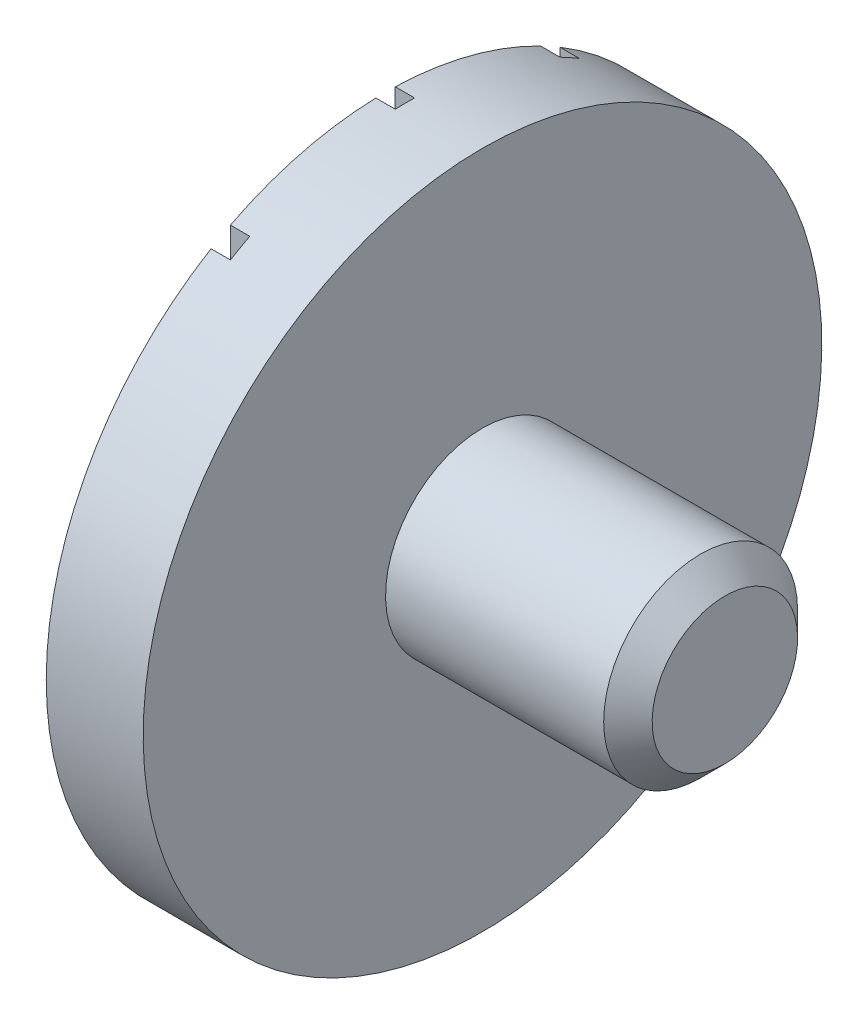
ISO-10303-21;
HEADER;
FILE_DESCRIPTION(('STEP AP214'),'2;1');
FILE_NAME('part.step','',(''),(''),'','','');
FILE_SCHEMA(('AUTOMOTIVE_DESIGN { 1 0 10303 214 1 1 1 1 }'));
ENDSEC;
DATA;
#1=APPLICATION_CONTEXT('core data for automotive mechanical design processes');
#2=APPLICATION_PROTOCOL_DEFINITION('international standard','automotive_design',2000,#1);
#3=PRODUCT_CONTEXT('',#1,'mechanical');
#4=PRODUCT('Part','Part','',(#3));
#5=PRODUCT_RELATED_PRODUCT_CATEGORY('part','',(#4));
#6=PRODUCT_DEFINITION_FORMATION('','',#4);
#7=PRODUCT_DEFINITION_CONTEXT('part definition',#1,'design');
#8=PRODUCT_DEFINITION('design','',#6,#7);
#9=PRODUCT_DEFINITION_SHAPE('','',#8);
#10=(LENGTH_UNIT() NAMED_UNIT(*) SI_UNIT(.MILLI.,.METRE.));
#11=(NAMED_UNIT(*) PLANE_ANGLE_UNIT() SI_UNIT($,.RADIAN.));
#12=(NAMED_UNIT(*) SI_UNIT($,.STERADIAN.) SOLID_ANGLE_UNIT());
#13=UNCERTAINTY_MEASURE_WITH_UNIT(LENGTH_MEASURE(1.E-05),#10,'distance_accuracy_value','');
#14=(GEOMETRIC_REPRESENTATION_CONTEXT(3) GLOBAL_UNCERTAINTY_ASSIGNED_CONTEXT((#13)) GLOBAL_UNIT_ASSIGNED_CONTEXT((#10,
#11,#12)) REPRESENTATION_CONTEXT('',''));
#15=CARTESIAN_POINT('',(0.,0.,0.));
#16=DIRECTION('',(0.,0.,1.));
#17=DIRECTION('',(1.,0.,0.));
#18=AXIS2_PLACEMENT_3D('',#15,#16,#17);
#19=CARTESIAN_POINT('',(0.,0.,0.));
#20=DIRECTION('',(1.,0.,0.));
#21=DIRECTION('',(0.,1.,0.));
#22=AXIS2_PLACEMENT_3D('',#19,#20,#21);
#23=PLANE('',#22);
#24=CARTESIAN_POINT('',(0.,0.,0.));
#25=DIRECTION('',(1.,0.,0.));
#26=DIRECTION('',(0.,1.,0.));
#27=AXIS2_PLACEMENT_3D('',#24,#25,#26);
#28=CIRCLE('',#27,1.75);
#29=CARTESIAN_POINT('',(0.,-1.50083310198037,-0.9));
#30=VERTEX_POINT('',#29);
#31=CARTESIAN_POINT('',(0.,1.50083310198037,-0.9));
#32=VERTEX_POINT('',#31);
#33=EDGE_CURVE('E257',#30,#32,#28,.T.);
#34=ORIENTED_EDGE('',*,*,#33,.F.);
#35=DIRECTION('',(0.,-1.,0.));
#36=VECTOR('',#35,1.);
#37=CARTESIAN_POINT('',(0.,-1.50083310198037,-0.9));
#38=LINE('',#37,#36);
#39=EDGE_CURVE('E141',#32,#30,#38,.T.);
#40=ORIENTED_EDGE('',*,*,#39,.F.);
#41=EDGE_LOOP('',(#34,#40));
#42=FACE_BOUND('',#41,.T.);
#43=ADVANCED_FACE('F36',(#42),#23,.F.);
#44=CARTESIAN_POINT('',(0.,1.50083310198037,0.9));
#45=VERTEX_POINT('',#44);
#46=CARTESIAN_POINT('',(0.,-1.50083310198037,0.9));
#47=VERTEX_POINT('',#46);
#48=EDGE_CURVE('E213',#45,#47,#28,.T.);
#49=ORIENTED_EDGE('',*,*,#48,.F.);
#50=DIRECTION('',(0.,1.,0.));
#51=VECTOR('',#50,1.);
#52=CARTESIAN_POINT('',(0.,-1.50083310198037,0.9));
#53=LINE('',#52,#51);
#54=EDGE_CURVE('E159',#47,#45,#53,.T.);
#55=ORIENTED_EDGE('',*,*,#54,.F.);
#56=EDGE_LOOP('',(#49,#55));
#57=FACE_BOUND('',#56,.T.);
#58=ADVANCED_FACE('F233',(#57),#23,.F.);
#59=CARTESIAN_POINT('',(0.,1.55643824162734,-0.8));
#60=VERTEX_POINT('',#59);
#61=CARTESIAN_POINT('',(0.,1.74928556845359,-0.0499999999999998));
#62=VERTEX_POINT('',#61);
#63=EDGE_CURVE('E210',#60,#62,#28,.T.);
#64=ORIENTED_EDGE('',*,*,#63,.F.);
#65=DIRECTION('',(0.,1.,0.));
#66=VECTOR('',#65,1.);
#67=CARTESIAN_POINT('',(0.,-1.55643824162734,-0.8));
#68=LINE('',#67,#66);
#69=CARTESIAN_POINT('',(0.,-1.55643824162734,-0.8));
#70=VERTEX_POINT('',#69);
#71=EDGE_CURVE('E266',#70,#60,#68,.T.);
#72=ORIENTED_EDGE('',*,*,#71,.F.);
#73=CARTESIAN_POINT('',(0.,-1.74928556845359,-0.05));
#74=VERTEX_POINT('',#73);
#75=EDGE_CURVE('E149',#74,#70,#28,.T.);
#76=ORIENTED_EDGE('',*,*,#75,.F.);
#77=DIRECTION('',(0.,-1.,0.));
#78=VECTOR('',#77,1.);
#79=CARTESIAN_POINT('',(0.,-1.74928556845359,-0.05));
#80=LINE('',#79,#78);
#81=EDGE_CURVE('E184',#62,#74,#80,.T.);
#82=ORIENTED_EDGE('',*,*,#81,.F.);
#83=EDGE_LOOP('',(#64,#72,#76,#82));
#84=FACE_BOUND('',#83,.T.);
#85=ADVANCED_FACE('F239',(#84),#23,.F.);
#86=CARTESIAN_POINT('',(0.,-1.55643824162734,0.8));
#87=VERTEX_POINT('',#86);
#88=CARTESIAN_POINT('',(0.,-1.74928556845359,0.05));
#89=VERTEX_POINT('',#88);
#90=EDGE_CURVE('E254',#87,#89,#28,.T.);
#91=ORIENTED_EDGE('',*,*,#90,.F.);
#92=DIRECTION('',(0.,-1.,0.));
#93=VECTOR('',#92,1.);
#94=CARTESIAN_POINT('',(0.,-1.55643824162734,0.8));
#95=LINE('',#94,#93);
#96=CARTESIAN_POINT('',(0.,1.55643824162734,0.8));
#97=VERTEX_POINT('',#96);
#98=EDGE_CURVE('E166',#97,#87,#95,.T.);
#99=ORIENTED_EDGE('',*,*,#98,.F.);
#100=CARTESIAN_POINT('',(0.,1.74928556845359,0.05));
#101=VERTEX_POINT('',#100);
#102=EDGE_CURVE('E211',#101,#97,#28,.T.);
#103=ORIENTED_EDGE('',*,*,#102,.F.);
#104=DIRECTION('',(0.,1.,0.));
#105=VECTOR('',#104,1.);
#106=CARTESIAN_POINT('',(0.,-1.74928556845359,0.05));
#107=LINE('',#106,#105);
#108=EDGE_CURVE('E173',#89,#101,#107,.T.);
#109=ORIENTED_EDGE('',*,*,#108,.F.);
#110=EDGE_LOOP('',(#91,#99,#103,#109));
#111=FACE_BOUND('',#110,.T.);
#112=ADVANCED_FACE('F235',(#111),#23,.F.);
#113=CARTESIAN_POINT('',(1.75,0.,0.));
#114=DIRECTION('',(1.,0.,0.));
#115=DIRECTION('',(0.,1.,0.));
#116=AXIS2_PLACEMENT_3D('',#113,#114,#115);
#117=CYLINDRICAL_SURFACE('',#116,1.75);
#118=ORIENTED_EDGE('',*,*,#33,.T.);
#119=DIRECTION('',(-1.,0.,0.));
#120=VECTOR('',#119,1.);
#121=CARTESIAN_POINT('',(0.100000000000004,1.50083310198037,-0.9));
#122=LINE('',#121,#120);
#123=CARTESIAN_POINT('',(0.100000000000004,1.50083310198037,-0.9));
#124=VERTEX_POINT('',#123);
#125=EDGE_CURVE('E151',#124,#32,#122,.T.);
#126=ORIENTED_EDGE('',*,*,#125,.F.);
#127=CARTESIAN_POINT('',(0.1,0.,0.));
#128=DIRECTION('',(-1.,0.,0.));
#129=DIRECTION('',(0.,-1.,0.));
#130=AXIS2_PLACEMENT_3D('',#127,#128,#129);
#131=CIRCLE('',#130,1.75);
#132=CARTESIAN_POINT('',(0.100000000000004,1.55643824162734,-0.8));
#133=VERTEX_POINT('',#132);
#134=EDGE_CURVE('E134',#133,#124,#131,.T.);
#135=ORIENTED_EDGE('',*,*,#134,.F.);
#136=DIRECTION('',(-1.,0.,0.));
#137=VECTOR('',#136,1.);
#138=CARTESIAN_POINT('',(0.100000000000004,1.55643824162734,-0.8));
#139=LINE('',#138,#137);
#140=EDGE_CURVE('E132',#133,#60,#139,.T.);
#141=ORIENTED_EDGE('',*,*,#140,.T.);
#142=ORIENTED_EDGE('',*,*,#63,.T.);
#143=DIRECTION('',(-1.,0.,0.));
#144=VECTOR('',#143,1.);
#145=CARTESIAN_POINT('',(0.100000000000005,1.74928556845359,-0.0499999999999998));
#146=LINE('',#145,#144);
#147=CARTESIAN_POINT('',(0.100000000000005,1.74928556845359,-0.0499999999999998));
#148=VERTEX_POINT('',#147);
#149=EDGE_CURVE('E197',#148,#62,#146,.T.);
#150=ORIENTED_EDGE('',*,*,#149,.F.);
#151=CARTESIAN_POINT('',(0.1,0.,0.));
#152=DIRECTION('',(-1.,0.,0.));
#153=DIRECTION('',(0.,-1.,0.));
#154=AXIS2_PLACEMENT_3D('',#151,#152,#153);
#155=CIRCLE('',#154,1.75);
#156=CARTESIAN_POINT('',(0.100000000000005,1.74928556845359,0.05));
#157=VERTEX_POINT('',#156);
#158=EDGE_CURVE('E187',#157,#148,#155,.T.);
#159=ORIENTED_EDGE('',*,*,#158,.F.);
#160=DIRECTION('',(-1.,0.,0.));
#161=VECTOR('',#160,1.);
#162=CARTESIAN_POINT('',(0.100000000000005,1.74928556845359,0.05));
#163=LINE('',#162,#161);
#164=EDGE_CURVE('E200',#157,#101,#163,.T.);
#165=ORIENTED_EDGE('',*,*,#164,.T.);
#166=ORIENTED_EDGE('',*,*,#102,.T.);
#167=DIRECTION('',(-1.,0.,0.));
#168=VECTOR('',#167,1.);
#169=CARTESIAN_POINT('',(0.100000000000004,1.55643824162734,0.8));
#170=LINE('',#169,#168);
#171=CARTESIAN_POINT('',(0.100000000000004,1.55643824162734,0.8));
#172=VERTEX_POINT('',#171);
#173=EDGE_CURVE('E165',#172,#97,#170,.T.);
#174=ORIENTED_EDGE('',*,*,#173,.F.);
#175=CARTESIAN_POINT('',(0.1,0.,0.));
#176=DIRECTION('',(-1.,0.,0.));
#177=DIRECTION('',(0.,-1.,0.));
#178=AXIS2_PLACEMENT_3D('',#175,#176,#177);
#179=CIRCLE('',#178,1.75);
#180=CARTESIAN_POINT('',(0.100000000000004,1.50083310198036,0.9));
#181=VERTEX_POINT('',#180);
#182=EDGE_CURVE('E156',#181,#172,#179,.T.);
#183=ORIENTED_EDGE('',*,*,#182,.F.);
#184=DIRECTION('',(-1.,0.,0.));
#185=VECTOR('',#184,1.);
#186=CARTESIAN_POINT('',(0.100000000000004,1.50083310198037,0.9));
#187=LINE('',#186,#185);
#188=EDGE_CURVE('E170',#181,#45,#187,.T.);
#189=ORIENTED_EDGE('',*,*,#188,.T.);
#190=ORIENTED_EDGE('',*,*,#48,.T.);
#191=DIRECTION('',(-1.,0.,0.));
#192=VECTOR('',#191,1.);
#193=CARTESIAN_POINT('',(0.099999999999996,-1.50083310198037,0.9));
#194=LINE('',#193,#192);
#195=CARTESIAN_POINT('',(0.099999999999996,-1.50083310198037,0.9));
#196=VERTEX_POINT('',#195);
#197=EDGE_CURVE('E174',#196,#47,#194,.T.);
#198=ORIENTED_EDGE('',*,*,#197,.F.);
#199=CARTESIAN_POINT('',(0.1,0.,0.));
#200=DIRECTION('',(-1.,0.,0.));
#201=DIRECTION('',(0.,-1.,0.));
#202=AXIS2_PLACEMENT_3D('',#199,#200,#201);
#203=CIRCLE('',#202,1.75);
#204=CARTESIAN_POINT('',(0.0999999999999958,-1.55643824162734,0.8));
#205=VERTEX_POINT('',#204);
#206=EDGE_CURVE('E162',#205,#196,#203,.T.);
#207=ORIENTED_EDGE('',*,*,#206,.F.);
#208=DIRECTION('',(-1.,0.,0.));
#209=VECTOR('',#208,1.);
#210=CARTESIAN_POINT('',(0.0999999999999958,-1.55643824162734,0.8));
#211=LINE('',#210,#209);
#212=EDGE_CURVE('E176',#205,#87,#211,.T.);
#213=ORIENTED_EDGE('',*,*,#212,.T.);
#214=ORIENTED_EDGE('',*,*,#90,.T.);
#215=DIRECTION('',(-1.,0.,0.));
#216=VECTOR('',#215,1.);
#217=CARTESIAN_POINT('',(0.0999999999999953,-1.74928556845359,0.05));
#218=LINE('',#217,#216);
#219=CARTESIAN_POINT('',(0.0999999999999953,-1.74928556845359,0.05));
#220=VERTEX_POINT('',#219);
#221=EDGE_CURVE('E191',#220,#89,#218,.T.);
#222=ORIENTED_EDGE('',*,*,#221,.F.);
#223=CARTESIAN_POINT('',(0.1,0.,0.));
#224=DIRECTION('',(-1.,0.,0.));
#225=DIRECTION('',(0.,-1.,0.));
#226=AXIS2_PLACEMENT_3D('',#223,#224,#225);
#227=CIRCLE('',#226,1.75);
#228=CARTESIAN_POINT('',(0.0999999999999953,-1.74928556845359,-0.05));
#229=VERTEX_POINT('',#228);
#230=EDGE_CURVE('E180',#229,#220,#227,.T.);
#231=ORIENTED_EDGE('',*,*,#230,.F.);
#232=DIRECTION('',(-1.,0.,0.));
#233=VECTOR('',#232,1.);
#234=CARTESIAN_POINT('',(0.0999999999999953,-1.74928556845359,-0.05));
#235=LINE('',#234,#233);
#236=EDGE_CURVE('E194',#229,#74,#235,.T.);
#237=ORIENTED_EDGE('',*,*,#236,.T.);
#238=ORIENTED_EDGE('',*,*,#75,.T.);
#239=DIRECTION('',(-1.,0.,0.));
#240=VECTOR('',#239,1.);
#241=CARTESIAN_POINT('',(0.0999999999999958,-1.55643824162734,-0.8));
#242=LINE('',#241,#240);
#243=CARTESIAN_POINT('',(0.0999999999999958,-1.55643824162734,-0.8));
#244=VERTEX_POINT('',#243);
#245=EDGE_CURVE('E129',#244,#70,#242,.T.);
#246=ORIENTED_EDGE('',*,*,#245,.F.);
#247=CARTESIAN_POINT('',(0.1,0.,0.));
#248=DIRECTION('',(-1.,0.,0.));
#249=DIRECTION('',(0.,-1.,0.));
#250=AXIS2_PLACEMENT_3D('',#247,#248,#249);
#251=CIRCLE('',#250,1.75);
#252=CARTESIAN_POINT('',(0.099999999999996,-1.50083310198036,-0.9));
#253=VERTEX_POINT('',#252);
#254=EDGE_CURVE('E135',#253,#244,#251,.T.);
#255=ORIENTED_EDGE('',*,*,#254,.F.);
#256=DIRECTION('',(-1.,0.,0.));
#257=VECTOR('',#256,1.);
#258=CARTESIAN_POINT('',(0.099999999999996,-1.50083310198037,-0.9));
#259=LINE('',#258,#257);
#260=EDGE_CURVE('E168',#253,#30,#259,.T.);
#261=ORIENTED_EDGE('',*,*,#260,.T.);
#262=EDGE_LOOP('',(#118,#126,#135,#141,#142,#150,#159,#165,#166,#174,#183,#189,#190,#198,#207,
#213,#214,#222,#231,#237,#238,#246,#255,#261));
#263=FACE_BOUND('',#262,.T.);
#264=CARTESIAN_POINT('',(0.500000000000005,0.,0.));
#265=DIRECTION('',(1.,0.,0.));
#266=DIRECTION('',(0.,1.,0.));
#267=AXIS2_PLACEMENT_3D('',#264,#265,#266);
#268=CIRCLE('',#267,1.75);
#269=CARTESIAN_POINT('',(0.50000000000001,1.75,0.));
#270=VERTEX_POINT('',#269);
#271=EDGE_CURVE('E207',#270,#270,#268,.T.);
#272=ORIENTED_EDGE('',*,*,#271,.F.);
#273=EDGE_LOOP('',(#272));
#274=FACE_BOUND('',#273,.T.);
#275=ADVANCED_FACE('F145',(#263,#274),#117,.T.);
#276=CARTESIAN_POINT('',(0.499999999999999,-1.75,0.));
#277=DIRECTION('',(-1.,0.,0.));
#278=DIRECTION('',(0.,-1.,0.));
#279=AXIS2_PLACEMENT_3D('',#276,#277,#278);
#280=PLANE('',#279);
#281=CARTESIAN_POINT('',(0.500000000000002,0.,0.));
#282=DIRECTION('',(1.,0.,0.));
#283=DIRECTION('',(0.,1.,0.));
#284=AXIS2_PLACEMENT_3D('',#281,#282,#283);
#285=CIRCLE('',#284,0.500000000000003);
#286=CARTESIAN_POINT('',(0.500000000000003,0.500000000000002,0.));
#287=VERTEX_POINT('',#286);
#288=EDGE_CURVE('E196',#287,#287,#285,.T.);
#289=ORIENTED_EDGE('',*,*,#288,.F.);
#290=EDGE_LOOP('',(#289));
#291=FACE_BOUND('',#290,.T.);
#292=ORIENTED_EDGE('',*,*,#271,.T.);
#293=EDGE_LOOP('',(#292));
#294=FACE_BOUND('',#293,.T.);
#295=ADVANCED_FACE('F249',(#291,#294),#280,.F.);
#296=CARTESIAN_POINT('',(1.75,0.,0.));
#297=DIRECTION('',(1.,0.,0.));
#298=DIRECTION('',(0.,1.,0.));
#299=AXIS2_PLACEMENT_3D('',#296,#297,#298);
#300=CYLINDRICAL_SURFACE('',#299,0.500000000000002);
#301=CARTESIAN_POINT('',(1.625,0.,0.));
#302=DIRECTION('',(-1.,0.,0.));
#303=DIRECTION('',(0.,-1.,0.));
#304=AXIS2_PLACEMENT_3D('',#301,#302,#303);
#305=CIRCLE('',#304,0.500000000000002);
#306=CARTESIAN_POINT('',(1.625,-0.500000000000006,0.));
#307=VERTEX_POINT('',#306);
#308=EDGE_CURVE('E11',#307,#307,#305,.T.);
#309=ORIENTED_EDGE('',*,*,#308,.T.);
#310=EDGE_LOOP('',(#309));
#311=FACE_BOUND('',#310,.T.);
#312=ORIENTED_EDGE('',*,*,#288,.T.);
#313=EDGE_LOOP('',(#312));
#314=FACE_BOUND('',#313,.T.);
#315=ADVANCED_FACE('F229',(#311,#314),#300,.T.);
#316=CARTESIAN_POINT('',(1.75,-0.500000000000005,0.));
#317=DIRECTION('',(-1.,0.,0.));
#318=DIRECTION('',(0.,-1.,0.));
#319=AXIS2_PLACEMENT_3D('',#316,#317,#318);
#320=PLANE('',#319);
#321=CARTESIAN_POINT('',(1.75,0.,0.));
#322=DIRECTION('',(-1.,0.,0.));
#323=DIRECTION('',(0.,-1.,0.));
#324=AXIS2_PLACEMENT_3D('',#321,#322,#323);
#325=CIRCLE('',#324,0.375000000000001);
#326=CARTESIAN_POINT('',(1.75,-0.375000000000006,0.));
#327=VERTEX_POINT('',#326);
#328=EDGE_CURVE('E44',#327,#327,#325,.F.);
#329=ORIENTED_EDGE('',*,*,#328,.T.);
#330=EDGE_LOOP('',(#329));
#331=FACE_BOUND('',#330,.T.);
#332=ADVANCED_FACE('F217',(#331),#320,.F.);
#333=CARTESIAN_POINT('',(1.75,0.,0.));
#334=DIRECTION('',(-1.,0.,0.));
#335=DIRECTION('',(0.,-1.,0.));
#336=AXIS2_PLACEMENT_3D('',#333,#334,#335);
#337=CONICAL_SURFACE('',#336,0.375000000000001,0.785398163397448);
#338=ORIENTED_EDGE('',*,*,#308,.F.);
#339=EDGE_LOOP('',(#338));
#340=FACE_BOUND('',#339,.T.);
#341=ORIENTED_EDGE('',*,*,#328,.F.);
#342=EDGE_LOOP('',(#341));
#343=FACE_BOUND('',#342,.T.);
#344=ADVANCED_FACE('F38',(#340,#343),#337,.T.);
#345=CARTESIAN_POINT('',(0.0999999999999953,-1.74928556845359,-0.05));
#346=DIRECTION('',(0.,0.,-1.));
#347=DIRECTION('',(-1.,0.,0.));
#348=AXIS2_PLACEMENT_3D('',#345,#346,#347);
#349=PLANE('',#348);
#350=ORIENTED_EDGE('',*,*,#81,.T.);
#351=ORIENTED_EDGE('',*,*,#236,.F.);
#352=DIRECTION('',(0.,-1.,0.));
#353=VECTOR('',#352,1.);
#354=CARTESIAN_POINT('',(0.0999999999999953,-1.74928556845359,-0.05));
#355=LINE('',#354,#353);
#356=EDGE_CURVE('E189',#148,#229,#355,.T.);
#357=ORIENTED_EDGE('',*,*,#356,.F.);
#358=ORIENTED_EDGE('',*,*,#149,.T.);
#359=EDGE_LOOP('',(#350,#351,#357,#358));
#360=FACE_BOUND('',#359,.T.);
#361=ADVANCED_FACE('F220',(#360),#349,.F.);
#362=CARTESIAN_POINT('',(0.0999999999999953,-1.74928556845359,0.05));
#363=DIRECTION('',(0.,0.,1.));
#364=DIRECTION('',(0.,-1.,0.));
#365=AXIS2_PLACEMENT_3D('',#362,#363,#364);
#366=PLANE('',#365);
#367=ORIENTED_EDGE('',*,*,#108,.T.);
#368=ORIENTED_EDGE('',*,*,#164,.F.);
#369=DIRECTION('',(0.,1.,0.));
#370=VECTOR('',#369,1.);
#371=CARTESIAN_POINT('',(0.0999999999999953,-1.74928556845359,0.05));
#372=LINE('',#371,#370);
#373=EDGE_CURVE('E183',#220,#157,#372,.T.);
#374=ORIENTED_EDGE('',*,*,#373,.F.);
#375=ORIENTED_EDGE('',*,*,#221,.T.);
#376=EDGE_LOOP('',(#367,#368,#374,#375));
#377=FACE_BOUND('',#376,.T.);
#378=ADVANCED_FACE('F226',(#377),#366,.F.);
#379=CARTESIAN_POINT('',(0.1,0.,0.));
#380=DIRECTION('',(-1.,0.,0.));
#381=DIRECTION('',(0.,-1.,0.));
#382=AXIS2_PLACEMENT_3D('',#379,#380,#381);
#383=PLANE('',#382);
#384=ORIENTED_EDGE('',*,*,#230,.T.);
#385=ORIENTED_EDGE('',*,*,#373,.T.);
#386=ORIENTED_EDGE('',*,*,#158,.T.);
#387=ORIENTED_EDGE('',*,*,#356,.T.);
#388=EDGE_LOOP('',(#384,#385,#386,#387));
#389=FACE_BOUND('',#388,.T.);
#390=ADVANCED_FACE('F289',(#389),#383,.T.);
#391=CARTESIAN_POINT('',(0.099999999999996,-1.50083310198037,0.9));
#392=DIRECTION('',(0.,0.,1.));
#393=DIRECTION('',(1.,0.,0.));
#394=AXIS2_PLACEMENT_3D('',#391,#392,#393);
#395=PLANE('',#394);
#396=ORIENTED_EDGE('',*,*,#54,.T.);
#397=ORIENTED_EDGE('',*,*,#188,.F.);
#398=DIRECTION('',(0.,1.,0.));
#399=VECTOR('',#398,1.);
#400=CARTESIAN_POINT('',(0.099999999999996,-1.50083310198037,0.9));
#401=LINE('',#400,#399);
#402=EDGE_CURVE('E59',#196,#181,#401,.T.);
#403=ORIENTED_EDGE('',*,*,#402,.F.);
#404=ORIENTED_EDGE('',*,*,#197,.T.);
#405=EDGE_LOOP('',(#396,#397,#403,#404));
#406=FACE_BOUND('',#405,.T.);
#407=ADVANCED_FACE('F286',(#406),#395,.F.);
#408=CARTESIAN_POINT('',(0.0999999999999958,-1.55643824162734,0.8));
#409=DIRECTION('',(0.,0.,-1.));
#410=DIRECTION('',(-1.,0.,0.));
#411=AXIS2_PLACEMENT_3D('',#408,#409,#410);
#412=PLANE('',#411);
#413=ORIENTED_EDGE('',*,*,#98,.T.);
#414=ORIENTED_EDGE('',*,*,#212,.F.);
#415=DIRECTION('',(0.,-1.,0.));
#416=VECTOR('',#415,1.);
#417=CARTESIAN_POINT('',(0.0999999999999958,-1.55643824162734,0.8));
#418=LINE('',#417,#416);
#419=EDGE_CURVE('E158',#172,#205,#418,.T.);
#420=ORIENTED_EDGE('',*,*,#419,.F.);
#421=ORIENTED_EDGE('',*,*,#173,.T.);
#422=EDGE_LOOP('',(#413,#414,#420,#421));
#423=FACE_BOUND('',#422,.T.);
#424=ADVANCED_FACE('F282',(#423),#412,.F.);
#425=CARTESIAN_POINT('',(0.1,0.,0.));
#426=DIRECTION('',(-1.,0.,0.));
#427=DIRECTION('',(0.,-1.,0.));
#428=AXIS2_PLACEMENT_3D('',#425,#426,#427);
#429=PLANE('',#428);
#430=ORIENTED_EDGE('',*,*,#182,.T.);
#431=ORIENTED_EDGE('',*,*,#419,.T.);
#432=ORIENTED_EDGE('',*,*,#206,.T.);
#433=ORIENTED_EDGE('',*,*,#402,.T.);
#434=EDGE_LOOP('',(#430,#431,#432,#433));
#435=FACE_BOUND('',#434,.T.);
#436=ADVANCED_FACE('F275',(#435),#429,.T.);
#437=CARTESIAN_POINT('',(0.099999999999996,-1.50083310198037,-0.9));
#438=DIRECTION('',(0.,0.,-1.));
#439=DIRECTION('',(-1.,0.,0.));
#440=AXIS2_PLACEMENT_3D('',#437,#438,#439);
#441=PLANE('',#440);
#442=ORIENTED_EDGE('',*,*,#39,.T.);
#443=ORIENTED_EDGE('',*,*,#260,.F.);
#444=DIRECTION('',(0.,-1.,0.));
#445=VECTOR('',#444,1.);
#446=CARTESIAN_POINT('',(0.099999999999996,-1.50083310198037,-0.9));
#447=LINE('',#446,#445);
#448=EDGE_CURVE('E51',#124,#253,#447,.T.);
#449=ORIENTED_EDGE('',*,*,#448,.F.);
#450=ORIENTED_EDGE('',*,*,#125,.T.);
#451=EDGE_LOOP('',(#442,#443,#449,#450));
#452=FACE_BOUND('',#451,.T.);
#453=ADVANCED_FACE('F273',(#452),#441,.F.);
#454=CARTESIAN_POINT('',(0.0999999999999958,-1.55643824162734,-0.8));
#455=DIRECTION('',(0.,0.,1.));
#456=DIRECTION('',(1.,0.,0.));
#457=AXIS2_PLACEMENT_3D('',#454,#455,#456);
#458=PLANE('',#457);
#459=ORIENTED_EDGE('',*,*,#71,.T.);
#460=ORIENTED_EDGE('',*,*,#140,.F.);
#461=DIRECTION('',(0.,1.,0.));
#462=VECTOR('',#461,1.);
#463=CARTESIAN_POINT('',(0.0999999999999958,-1.55643824162734,-0.8));
#464=LINE('',#463,#462);
#465=EDGE_CURVE('E126',#244,#133,#464,.T.);
#466=ORIENTED_EDGE('',*,*,#465,.F.);
#467=ORIENTED_EDGE('',*,*,#245,.T.);
#468=EDGE_LOOP('',(#459,#460,#466,#467));
#469=FACE_BOUND('',#468,.T.);
#470=ADVANCED_FACE('F127',(#469),#458,.F.);
#471=CARTESIAN_POINT('',(0.1,0.,0.));
#472=DIRECTION('',(-1.,0.,0.));
#473=DIRECTION('',(0.,-1.,0.));
#474=AXIS2_PLACEMENT_3D('',#471,#472,#473);
#475=PLANE('',#474);
#476=ORIENTED_EDGE('',*,*,#254,.T.);
#477=ORIENTED_EDGE('',*,*,#465,.T.);
#478=ORIENTED_EDGE('',*,*,#134,.T.);
#479=ORIENTED_EDGE('',*,*,#448,.T.);
#480=EDGE_LOOP('',(#476,#477,#478,#479));
#481=FACE_BOUND('',#480,.T.);
#482=ADVANCED_FACE('F138',(#481),#475,.T.);
#483=CLOSED_SHELL('',(#43,#58,#85,#112,#275,#295,#315,#332,#344,#361,#378,#390,#407,#424,#436,
#453,#470,#482));
#484=MANIFOLD_SOLID_BREP('B2',#483);
#485=ADVANCED_BREP_SHAPE_REPRESENTATION('',(#18,#484),#14);
#486=SHAPE_DEFINITION_REPRESENTATION(#9,#485);
ENDSEC;
END-ISO-10303-21;
